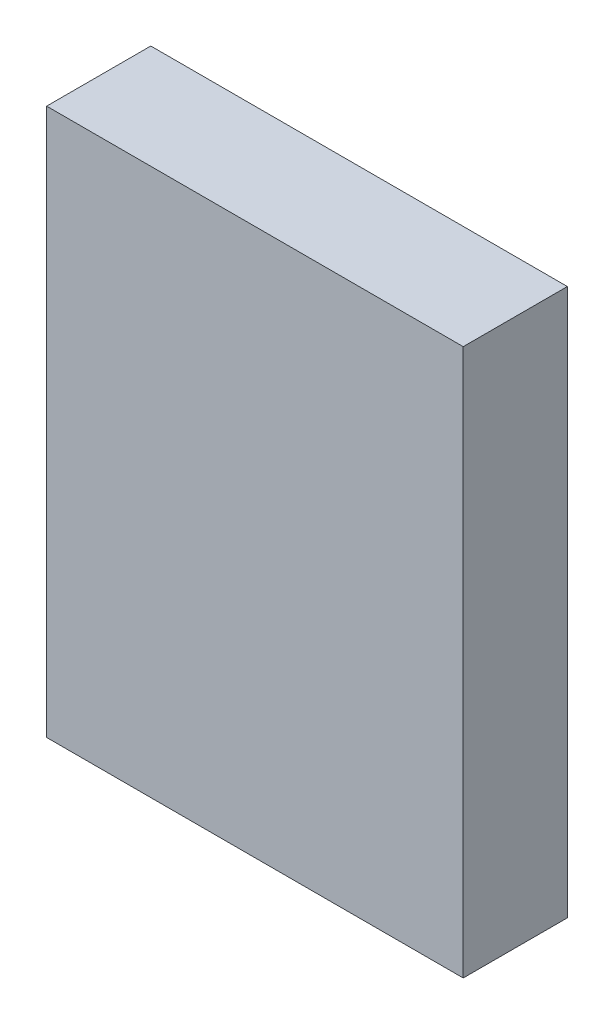
ISO-10303-21;
HEADER;
FILE_DESCRIPTION(('STEP AP214'),'2;1');
FILE_NAME('part.step','',(''),(''),'','','');
FILE_SCHEMA(('AUTOMOTIVE_DESIGN { 1 0 10303 214 1 1 1 1 }'));
ENDSEC;
DATA;
#1=APPLICATION_CONTEXT('core data for automotive mechanical design processes');
#2=APPLICATION_PROTOCOL_DEFINITION('international standard','automotive_design',2000,#1);
#3=PRODUCT_CONTEXT('',#1,'mechanical');
#4=PRODUCT('Part','Part','',(#3));
#5=PRODUCT_RELATED_PRODUCT_CATEGORY('part','',(#4));
#6=PRODUCT_DEFINITION_FORMATION('','',#4);
#7=PRODUCT_DEFINITION_CONTEXT('part definition',#1,'design');
#8=PRODUCT_DEFINITION('design','',#6,#7);
#9=PRODUCT_DEFINITION_SHAPE('','',#8);
#10=(LENGTH_UNIT() NAMED_UNIT(*) SI_UNIT(.MILLI.,.METRE.));
#11=(NAMED_UNIT(*) PLANE_ANGLE_UNIT() SI_UNIT($,.RADIAN.));
#12=(NAMED_UNIT(*) SI_UNIT($,.STERADIAN.) SOLID_ANGLE_UNIT());
#13=UNCERTAINTY_MEASURE_WITH_UNIT(LENGTH_MEASURE(1.E-05),#10,'distance_accuracy_value','');
#14=(GEOMETRIC_REPRESENTATION_CONTEXT(3) GLOBAL_UNCERTAINTY_ASSIGNED_CONTEXT((#13)) GLOBAL_UNIT_ASSIGNED_CONTEXT((#10,
#11,#12)) REPRESENTATION_CONTEXT('',''));
#15=CARTESIAN_POINT('',(0.,0.,0.));
#16=DIRECTION('',(0.,0.,1.));
#17=DIRECTION('',(1.,0.,0.));
#18=AXIS2_PLACEMENT_3D('',#15,#16,#17);
#19=CARTESIAN_POINT('',(-1.825,-2.8255,0.));
#20=DIRECTION('',(1.,0.,0.));
#21=DIRECTION('',(0.,0.,1.));
#22=AXIS2_PLACEMENT_3D('',#19,#20,#21);
#23=PLANE('',#22);
#24=DIRECTION('',(0.,1.,0.));
#25=VECTOR('',#24,1.);
#26=CARTESIAN_POINT('',(-1.825,-2.8255,0.1));
#27=LINE('',#26,#25);
#28=CARTESIAN_POINT('',(-1.825,-2.8255,0.1));
#29=VERTEX_POINT('',#28);
#30=CARTESIAN_POINT('',(-1.825,-2.3005,0.1));
#31=VERTEX_POINT('',#30);
#32=EDGE_CURVE('E11',#29,#31,#27,.T.);
#33=ORIENTED_EDGE('',*,*,#32,.T.);
#34=DIRECTION('',(0.,0.,1.));
#35=VECTOR('',#34,1.);
#36=CARTESIAN_POINT('',(-1.825,-2.3005,0.));
#37=LINE('',#36,#35);
#38=CARTESIAN_POINT('',(-1.825,-2.3005,0.));
#39=VERTEX_POINT('',#38);
#40=EDGE_CURVE('E24',#39,#31,#37,.T.);
#41=ORIENTED_EDGE('',*,*,#40,.F.);
#42=DIRECTION('',(0.,1.,0.));
#43=VECTOR('',#42,1.);
#44=CARTESIAN_POINT('',(-1.825,-2.8255,0.));
#45=LINE('',#44,#43);
#46=CARTESIAN_POINT('',(-1.825,-2.8255,0.));
#47=VERTEX_POINT('',#46);
#48=EDGE_CURVE('E86',#47,#39,#45,.T.);
#49=ORIENTED_EDGE('',*,*,#48,.F.);
#50=DIRECTION('',(0.,0.,1.));
#51=VECTOR('',#50,1.);
#52=CARTESIAN_POINT('',(-1.825,-2.8255,0.));
#53=LINE('',#52,#51);
#54=EDGE_CURVE('E36',#47,#29,#53,.T.);
#55=ORIENTED_EDGE('',*,*,#54,.T.);
#56=EDGE_LOOP('',(#33,#41,#49,#55));
#57=FACE_BOUND('',#56,.T.);
#58=ADVANCED_FACE('F17',(#57),#23,.F.);
#59=CARTESIAN_POINT('',(-1.425,-2.8255,0.));
#60=DIRECTION('',(1.,0.,0.));
#61=DIRECTION('',(0.,0.,1.));
#62=AXIS2_PLACEMENT_3D('',#59,#60,#61);
#63=PLANE('',#62);
#64=DIRECTION('',(0.,0.,1.));
#65=VECTOR('',#64,1.);
#66=CARTESIAN_POINT('',(-1.425,-2.8255,0.));
#67=LINE('',#66,#65);
#68=CARTESIAN_POINT('',(-1.425,-2.8255,0.));
#69=VERTEX_POINT('',#68);
#70=CARTESIAN_POINT('',(-1.425,-2.8255,0.1));
#71=VERTEX_POINT('',#70);
#72=EDGE_CURVE('E83',#69,#71,#67,.T.);
#73=ORIENTED_EDGE('',*,*,#72,.F.);
#74=DIRECTION('',(0.,1.,0.));
#75=VECTOR('',#74,1.);
#76=CARTESIAN_POINT('',(-1.425,-2.8255,0.));
#77=LINE('',#76,#75);
#78=CARTESIAN_POINT('',(-1.425,-2.3005,0.));
#79=VERTEX_POINT('',#78);
#80=EDGE_CURVE('E63',#69,#79,#77,.T.);
#81=ORIENTED_EDGE('',*,*,#80,.T.);
#82=DIRECTION('',(0.,0.,1.));
#83=VECTOR('',#82,1.);
#84=CARTESIAN_POINT('',(-1.425,-2.3005,0.));
#85=LINE('',#84,#83);
#86=CARTESIAN_POINT('',(-1.425,-2.3005,0.1));
#87=VERTEX_POINT('',#86);
#88=EDGE_CURVE('E57',#79,#87,#85,.T.);
#89=ORIENTED_EDGE('',*,*,#88,.T.);
#90=DIRECTION('',(0.,1.,0.));
#91=VECTOR('',#90,1.);
#92=CARTESIAN_POINT('',(-1.425,-2.8255,0.1));
#93=LINE('',#92,#91);
#94=EDGE_CURVE('E60',#71,#87,#93,.T.);
#95=ORIENTED_EDGE('',*,*,#94,.F.);
#96=EDGE_LOOP('',(#73,#81,#89,#95));
#97=FACE_BOUND('',#96,.T.);
#98=ADVANCED_FACE('F59',(#97),#63,.T.);
#99=CARTESIAN_POINT('',(-1.825,-2.8255,0.));
#100=DIRECTION('',(0.,1.,0.));
#101=DIRECTION('',(0.,0.,1.));
#102=AXIS2_PLACEMENT_3D('',#99,#100,#101);
#103=PLANE('',#102);
#104=ORIENTED_EDGE('',*,*,#72,.T.);
#105=DIRECTION('',(1.,0.,0.));
#106=VECTOR('',#105,1.);
#107=CARTESIAN_POINT('',(-1.825,-2.8255,0.1));
#108=LINE('',#107,#106);
#109=EDGE_CURVE('E71',#29,#71,#108,.T.);
#110=ORIENTED_EDGE('',*,*,#109,.F.);
#111=ORIENTED_EDGE('',*,*,#54,.F.);
#112=DIRECTION('',(1.,0.,0.));
#113=VECTOR('',#112,1.);
#114=CARTESIAN_POINT('',(-1.825,-2.8255,0.));
#115=LINE('',#114,#113);
#116=EDGE_CURVE('E76',#47,#69,#115,.T.);
#117=ORIENTED_EDGE('',*,*,#116,.T.);
#118=EDGE_LOOP('',(#104,#110,#111,#117));
#119=FACE_BOUND('',#118,.T.);
#120=ADVANCED_FACE('F91',(#119),#103,.F.);
#121=CARTESIAN_POINT('',(-1.825,-2.3005,0.));
#122=DIRECTION('',(0.,1.,0.));
#123=DIRECTION('',(0.,0.,1.));
#124=AXIS2_PLACEMENT_3D('',#121,#122,#123);
#125=PLANE('',#124);
#126=DIRECTION('',(1.,0.,0.));
#127=VECTOR('',#126,1.);
#128=CARTESIAN_POINT('',(-1.825,-2.3005,0.));
#129=LINE('',#128,#127);
#130=EDGE_CURVE('E74',#39,#79,#129,.T.);
#131=ORIENTED_EDGE('',*,*,#130,.F.);
#132=ORIENTED_EDGE('',*,*,#40,.T.);
#133=DIRECTION('',(1.,0.,0.));
#134=VECTOR('',#133,1.);
#135=CARTESIAN_POINT('',(-1.825,-2.3005,0.1));
#136=LINE('',#135,#134);
#137=EDGE_CURVE('E69',#31,#87,#136,.T.);
#138=ORIENTED_EDGE('',*,*,#137,.T.);
#139=ORIENTED_EDGE('',*,*,#88,.F.);
#140=EDGE_LOOP('',(#131,#132,#138,#139));
#141=FACE_BOUND('',#140,.T.);
#142=ADVANCED_FACE('F73',(#141),#125,.T.);
#143=CARTESIAN_POINT('',(-1.825,-2.8255,0.));
#144=DIRECTION('',(0.,0.,1.));
#145=DIRECTION('',(1.,0.,0.));
#146=AXIS2_PLACEMENT_3D('',#143,#144,#145);
#147=PLANE('',#146);
#148=ORIENTED_EDGE('',*,*,#130,.T.);
#149=ORIENTED_EDGE('',*,*,#80,.F.);
#150=ORIENTED_EDGE('',*,*,#116,.F.);
#151=ORIENTED_EDGE('',*,*,#48,.T.);
#152=EDGE_LOOP('',(#148,#149,#150,#151));
#153=FACE_BOUND('',#152,.T.);
#154=ADVANCED_FACE('F89',(#153),#147,.F.);
#155=CARTESIAN_POINT('',(-1.825,-2.8255,0.1));
#156=DIRECTION('',(0.,0.,1.));
#157=DIRECTION('',(1.,0.,0.));
#158=AXIS2_PLACEMENT_3D('',#155,#156,#157);
#159=PLANE('',#158);
#160=ORIENTED_EDGE('',*,*,#32,.F.);
#161=ORIENTED_EDGE('',*,*,#109,.T.);
#162=ORIENTED_EDGE('',*,*,#94,.T.);
#163=ORIENTED_EDGE('',*,*,#137,.F.);
#164=EDGE_LOOP('',(#160,#161,#162,#163));
#165=FACE_BOUND('',#164,.T.);
#166=ADVANCED_FACE('F68',(#165),#159,.T.);
#167=CLOSED_SHELL('',(#58,#98,#120,#142,#154,#166));
#168=MANIFOLD_SOLID_BREP('B1',#167);
#169=ADVANCED_BREP_SHAPE_REPRESENTATION('',(#18,#168),#14);
#170=SHAPE_DEFINITION_REPRESENTATION(#9,#169);
ENDSEC;
END-ISO-10303-21;
